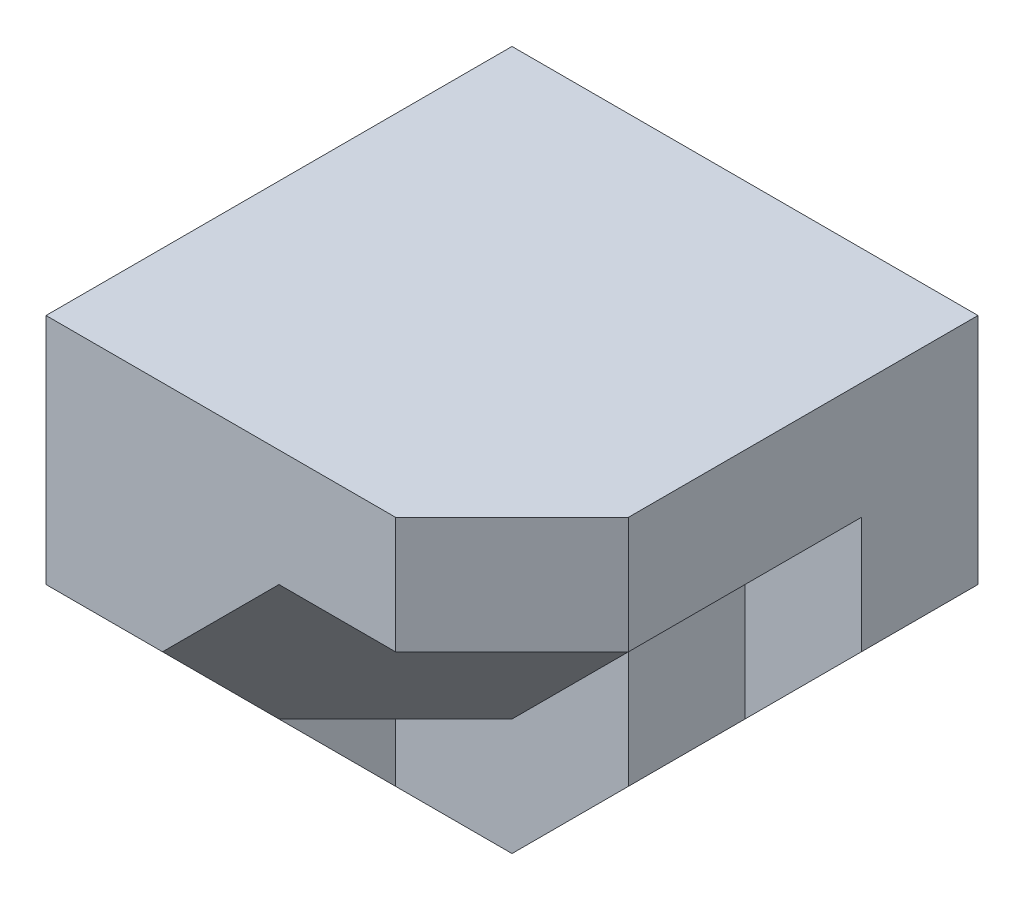
ISO-10303-21;
HEADER;
FILE_DESCRIPTION(('STEP AP214'),'2;1');
FILE_NAME('part.step','',(''),(''),'','','');
FILE_SCHEMA(('AUTOMOTIVE_DESIGN { 1 0 10303 214 1 1 1 1 }'));
ENDSEC;
DATA;
#1=APPLICATION_CONTEXT('core data for automotive mechanical design processes');
#2=APPLICATION_PROTOCOL_DEFINITION('international standard','automotive_design',2000,#1);
#3=PRODUCT_CONTEXT('',#1,'mechanical');
#4=PRODUCT('Part','Part','',(#3));
#5=PRODUCT_RELATED_PRODUCT_CATEGORY('part','',(#4));
#6=PRODUCT_DEFINITION_FORMATION('','',#4);
#7=PRODUCT_DEFINITION_CONTEXT('part definition',#1,'design');
#8=PRODUCT_DEFINITION('design','',#6,#7);
#9=PRODUCT_DEFINITION_SHAPE('','',#8);
#10=(LENGTH_UNIT() NAMED_UNIT(*) SI_UNIT(.MILLI.,.METRE.));
#11=(NAMED_UNIT(*) PLANE_ANGLE_UNIT() SI_UNIT($,.RADIAN.));
#12=(NAMED_UNIT(*) SI_UNIT($,.STERADIAN.) SOLID_ANGLE_UNIT());
#13=UNCERTAINTY_MEASURE_WITH_UNIT(LENGTH_MEASURE(1.E-05),#10,'distance_accuracy_value','');
#14=(GEOMETRIC_REPRESENTATION_CONTEXT(3) GLOBAL_UNCERTAINTY_ASSIGNED_CONTEXT((#13)) GLOBAL_UNIT_ASSIGNED_CONTEXT((#10,
#11,#12)) REPRESENTATION_CONTEXT('',''));
#15=CARTESIAN_POINT('',(0.,0.,0.));
#16=DIRECTION('',(0.,0.,1.));
#17=DIRECTION('',(1.,0.,0.));
#18=AXIS2_PLACEMENT_3D('',#15,#16,#17);
#19=CARTESIAN_POINT('',(0.,0.,20.));
#20=DIRECTION('',(0.,0.,-1.));
#21=DIRECTION('',(-1.,0.,0.));
#22=AXIS2_PLACEMENT_3D('',#19,#20,#21);
#23=PLANE('',#22);
#24=DIRECTION('',(0.707106781186548,0.707106781186548,0.));
#25=VECTOR('',#24,1.);
#26=CARTESIAN_POINT('',(40.,30.,20.));
#27=LINE('',#26,#25);
#28=CARTESIAN_POINT('',(20.,10.,20.));
#29=VERTEX_POINT('',#28);
#30=CARTESIAN_POINT('',(30.,20.,20.));
#31=VERTEX_POINT('',#30);
#32=EDGE_CURVE('E78',#29,#31,#27,.T.);
#33=ORIENTED_EDGE('',*,*,#32,.F.);
#34=DIRECTION('',(1.,0.,0.));
#35=VECTOR('',#34,1.);
#36=CARTESIAN_POINT('',(20.,10.,20.));
#37=LINE('',#36,#35);
#38=CARTESIAN_POINT('',(10.,10.,20.));
#39=VERTEX_POINT('',#38);
#40=EDGE_CURVE('E179',#39,#29,#37,.T.);
#41=ORIENTED_EDGE('',*,*,#40,.F.);
#42=DIRECTION('',(0.,-1.,0.));
#43=VECTOR('',#42,1.);
#44=CARTESIAN_POINT('',(10.,30.,20.));
#45=LINE('',#44,#43);
#46=CARTESIAN_POINT('',(10.,0.,20.));
#47=VERTEX_POINT('',#46);
#48=EDGE_CURVE('E126',#39,#47,#45,.T.);
#49=ORIENTED_EDGE('',*,*,#48,.T.);
#50=DIRECTION('',(1.,0.,0.));
#51=VECTOR('',#50,1.);
#52=CARTESIAN_POINT('',(0.,0.,20.));
#53=LINE('',#52,#51);
#54=CARTESIAN_POINT('',(20.,0.,20.));
#55=VERTEX_POINT('',#54);
#56=EDGE_CURVE('E145',#47,#55,#53,.T.);
#57=ORIENTED_EDGE('',*,*,#56,.T.);
#58=DIRECTION('',(-0.707106781186548,-0.707106781186548,0.));
#59=VECTOR('',#58,1.);
#60=CARTESIAN_POINT('',(20.,0.,20.));
#61=LINE('',#60,#59);
#62=CARTESIAN_POINT('',(30.,10.,20.));
#63=VERTEX_POINT('',#62);
#64=EDGE_CURVE('E317',#63,#55,#61,.T.);
#65=ORIENTED_EDGE('',*,*,#64,.F.);
#66=DIRECTION('',(0.,1.,0.));
#67=VECTOR('',#66,1.);
#68=CARTESIAN_POINT('',(30.,0.,20.));
#69=LINE('',#68,#67);
#70=EDGE_CURVE('E123',#63,#31,#69,.T.);
#71=ORIENTED_EDGE('',*,*,#70,.T.);
#72=EDGE_LOOP('',(#33,#41,#49,#57,#65,#71));
#73=FACE_BOUND('',#72,.T.);
#74=ADVANCED_FACE('F36',(#73),#23,.F.);
#75=CARTESIAN_POINT('',(10.,0.,0.));
#76=DIRECTION('',(-1.,0.,0.));
#77=DIRECTION('',(0.,0.,1.));
#78=AXIS2_PLACEMENT_3D('',#75,#76,#77);
#79=PLANE('',#78);
#80=DIRECTION('',(0.,0.,-1.));
#81=VECTOR('',#80,1.);
#82=CARTESIAN_POINT('',(10.,10.,40.));
#83=LINE('',#82,#81);
#84=CARTESIAN_POINT('',(10.,10.,30.));
#85=VERTEX_POINT('',#84);
#86=EDGE_CURVE('E183',#85,#39,#83,.T.);
#87=ORIENTED_EDGE('',*,*,#86,.F.);
#88=DIRECTION('',(0.,0.707106781186547,0.707106781186548));
#89=VECTOR('',#88,1.);
#90=CARTESIAN_POINT('',(10.,10.,30.));
#91=LINE('',#90,#89);
#92=EDGE_CURVE('E198',#47,#85,#91,.T.);
#93=ORIENTED_EDGE('',*,*,#92,.F.);
#94=ORIENTED_EDGE('',*,*,#48,.F.);
#95=EDGE_LOOP('',(#87,#93,#94));
#96=FACE_BOUND('',#95,.T.);
#97=ADVANCED_FACE('F350',(#96),#79,.F.);
#98=CARTESIAN_POINT('',(40.,0.,20.));
#99=DIRECTION('',(-1.,0.,0.));
#100=DIRECTION('',(0.,0.,1.));
#101=AXIS2_PLACEMENT_3D('',#98,#99,#100);
#102=PLANE('',#101);
#103=DIRECTION('',(0.,0.,-1.));
#104=VECTOR('',#103,1.);
#105=CARTESIAN_POINT('',(40.,40.,20.));
#106=LINE('',#105,#104);
#107=CARTESIAN_POINT('',(40.,40.,30.));
#108=VERTEX_POINT('',#107);
#109=CARTESIAN_POINT('',(40.,40.,0.));
#110=VERTEX_POINT('',#109);
#111=EDGE_CURVE('E143',#108,#110,#106,.T.);
#112=ORIENTED_EDGE('',*,*,#111,.F.);
#113=DIRECTION('',(0.,-1.,0.));
#114=VECTOR('',#113,1.);
#115=CARTESIAN_POINT('',(40.,70.,30.));
#116=LINE('',#115,#114);
#117=CARTESIAN_POINT('',(40.,30.,30.));
#118=VERTEX_POINT('',#117);
#119=EDGE_CURVE('E97',#108,#118,#116,.T.);
#120=ORIENTED_EDGE('',*,*,#119,.T.);
#121=DIRECTION('',(0.,0.,-1.));
#122=VECTOR('',#121,1.);
#123=CARTESIAN_POINT('',(40.,30.,10.));
#124=LINE('',#123,#122);
#125=CARTESIAN_POINT('',(40.,30.,20.));
#126=VERTEX_POINT('',#125);
#127=EDGE_CURVE('E54',#118,#126,#124,.T.);
#128=ORIENTED_EDGE('',*,*,#127,.T.);
#129=DIRECTION('',(0.,0.,1.));
#130=VECTOR('',#129,1.);
#131=CARTESIAN_POINT('',(40.,30.,10.));
#132=LINE('',#131,#130);
#133=CARTESIAN_POINT('',(40.,30.,10.));
#134=VERTEX_POINT('',#133);
#135=EDGE_CURVE('E95',#134,#126,#132,.T.);
#136=ORIENTED_EDGE('',*,*,#135,.F.);
#137=DIRECTION('',(0.,1.,0.));
#138=VECTOR('',#137,1.);
#139=CARTESIAN_POINT('',(40.,0.,10.));
#140=LINE('',#139,#138);
#141=CARTESIAN_POINT('',(40.,20.,10.));
#142=VERTEX_POINT('',#141);
#143=EDGE_CURVE('E127',#142,#134,#140,.T.);
#144=ORIENTED_EDGE('',*,*,#143,.F.);
#145=DIRECTION('',(0.,0.,1.));
#146=VECTOR('',#145,1.);
#147=CARTESIAN_POINT('',(40.,20.,0.));
#148=LINE('',#147,#146);
#149=CARTESIAN_POINT('',(40.,20.,0.));
#150=VERTEX_POINT('',#149);
#151=EDGE_CURVE('E165',#150,#142,#148,.T.);
#152=ORIENTED_EDGE('',*,*,#151,.F.);
#153=DIRECTION('',(0.,1.,0.));
#154=VECTOR('',#153,1.);
#155=CARTESIAN_POINT('',(40.,0.,0.));
#156=LINE('',#155,#154);
#157=EDGE_CURVE('E98',#150,#110,#156,.T.);
#158=ORIENTED_EDGE('',*,*,#157,.T.);
#159=EDGE_LOOP('',(#112,#120,#128,#136,#144,#152,#158));
#160=FACE_BOUND('',#159,.T.);
#161=ADVANCED_FACE('F92',(#160),#102,.F.);
#162=CARTESIAN_POINT('',(20.,0.,0.));
#163=DIRECTION('',(-0.707106781186548,0.707106781186548,0.));
#164=DIRECTION('',(-0.707106781186548,-0.707106781186548,0.));
#165=AXIS2_PLACEMENT_3D('',#162,#163,#164);
#166=PLANE('',#165);
#167=DIRECTION('',(0.,0.,1.));
#168=VECTOR('',#167,1.);
#169=CARTESIAN_POINT('',(30.,10.,10.));
#170=LINE('',#169,#168);
#171=CARTESIAN_POINT('',(30.,10.,10.));
#172=VERTEX_POINT('',#171);
#173=EDGE_CURVE('E121',#172,#63,#170,.T.);
#174=ORIENTED_EDGE('',*,*,#173,.T.);
#175=ORIENTED_EDGE('',*,*,#64,.T.);
#176=DIRECTION('',(0.,0.,1.));
#177=VECTOR('',#176,1.);
#178=CARTESIAN_POINT('',(20.,0.,0.));
#179=LINE('',#178,#177);
#180=CARTESIAN_POINT('',(20.,0.,0.));
#181=VERTEX_POINT('',#180);
#182=EDGE_CURVE('E310',#181,#55,#179,.T.);
#183=ORIENTED_EDGE('',*,*,#182,.F.);
#184=DIRECTION('',(-0.707106781186548,-0.707106781186548,0.));
#185=VECTOR('',#184,1.);
#186=CARTESIAN_POINT('',(20.,0.,0.));
#187=LINE('',#186,#185);
#188=EDGE_CURVE('E109',#150,#181,#187,.T.);
#189=ORIENTED_EDGE('',*,*,#188,.F.);
#190=ORIENTED_EDGE('',*,*,#151,.T.);
#191=DIRECTION('',(0.707106781186548,0.707106781186548,0.));
#192=VECTOR('',#191,1.);
#193=CARTESIAN_POINT('',(10.,-10.,10.));
#194=LINE('',#193,#192);
#195=EDGE_CURVE('E130',#172,#142,#194,.T.);
#196=ORIENTED_EDGE('',*,*,#195,.F.);
#197=EDGE_LOOP('',(#174,#175,#183,#189,#190,#196));
#198=FACE_BOUND('',#197,.T.);
#199=ADVANCED_FACE('F330',(#198),#166,.F.);
#200=CARTESIAN_POINT('',(0.,0.,20.));
#201=DIRECTION('',(1.,0.,0.));
#202=DIRECTION('',(0.,0.,-1.));
#203=AXIS2_PLACEMENT_3D('',#200,#201,#202);
#204=PLANE('',#203);
#205=DIRECTION('',(0.,0.,-1.));
#206=VECTOR('',#205,1.);
#207=CARTESIAN_POINT('',(0.,0.,20.));
#208=LINE('',#207,#206);
#209=CARTESIAN_POINT('',(0.,0.,20.));
#210=VERTEX_POINT('',#209);
#211=CARTESIAN_POINT('',(0.,0.,0.));
#212=VERTEX_POINT('',#211);
#213=EDGE_CURVE('E137',#210,#212,#208,.T.);
#214=ORIENTED_EDGE('',*,*,#213,.F.);
#215=DIRECTION('',(0.,0.707106781186547,0.707106781186548));
#216=VECTOR('',#215,1.);
#217=CARTESIAN_POINT('',(0.,10.,30.));
#218=LINE('',#217,#216);
#219=CARTESIAN_POINT('',(0.,10.,30.));
#220=VERTEX_POINT('',#219);
#221=EDGE_CURVE('E162',#210,#220,#218,.T.);
#222=ORIENTED_EDGE('',*,*,#221,.T.);
#223=DIRECTION('',(0.,1.,0.));
#224=VECTOR('',#223,1.);
#225=CARTESIAN_POINT('',(0.,20.,30.));
#226=LINE('',#225,#224);
#227=CARTESIAN_POINT('',(0.,20.,30.));
#228=VERTEX_POINT('',#227);
#229=EDGE_CURVE('E153',#220,#228,#226,.T.);
#230=ORIENTED_EDGE('',*,*,#229,.T.);
#231=DIRECTION('',(0.,0.,1.));
#232=VECTOR('',#231,1.);
#233=CARTESIAN_POINT('',(0.,20.,20.));
#234=LINE('',#233,#232);
#235=CARTESIAN_POINT('',(0.,20.,40.));
#236=VERTEX_POINT('',#235);
#237=EDGE_CURVE('E149',#228,#236,#234,.T.);
#238=ORIENTED_EDGE('',*,*,#237,.T.);
#239=DIRECTION('',(0.,-1.,0.));
#240=VECTOR('',#239,1.);
#241=CARTESIAN_POINT('',(0.,40.,40.));
#242=LINE('',#241,#240);
#243=CARTESIAN_POINT('',(0.,40.,40.));
#244=VERTEX_POINT('',#243);
#245=EDGE_CURVE('E138',#244,#236,#242,.T.);
#246=ORIENTED_EDGE('',*,*,#245,.F.);
#247=DIRECTION('',(0.,0.,-1.));
#248=VECTOR('',#247,1.);
#249=CARTESIAN_POINT('',(0.,40.,20.));
#250=LINE('',#249,#248);
#251=CARTESIAN_POINT('',(0.,40.,0.));
#252=VERTEX_POINT('',#251);
#253=EDGE_CURVE('E152',#244,#252,#250,.T.);
#254=ORIENTED_EDGE('',*,*,#253,.T.);
#255=DIRECTION('',(0.,-1.,0.));
#256=VECTOR('',#255,1.);
#257=CARTESIAN_POINT('',(0.,0.,0.));
#258=LINE('',#257,#256);
#259=EDGE_CURVE('E298',#252,#212,#258,.T.);
#260=ORIENTED_EDGE('',*,*,#259,.T.);
#261=EDGE_LOOP('',(#214,#222,#230,#238,#246,#254,#260));
#262=FACE_BOUND('',#261,.T.);
#263=ADVANCED_FACE('F221',(#262),#204,.F.);
#264=CARTESIAN_POINT('',(0.,0.,20.));
#265=DIRECTION('',(0.,1.,0.));
#266=DIRECTION('',(0.,0.,1.));
#267=AXIS2_PLACEMENT_3D('',#264,#265,#266);
#268=PLANE('',#267);
#269=DIRECTION('',(1.,0.,0.));
#270=VECTOR('',#269,1.);
#271=CARTESIAN_POINT('',(0.,0.,0.));
#272=LINE('',#271,#270);
#273=EDGE_CURVE('E308',#212,#181,#272,.T.);
#274=ORIENTED_EDGE('',*,*,#273,.T.);
#275=ORIENTED_EDGE('',*,*,#182,.T.);
#276=ORIENTED_EDGE('',*,*,#56,.F.);
#277=EDGE_CURVE('E159',#210,#47,#53,.T.);
#278=ORIENTED_EDGE('',*,*,#277,.F.);
#279=ORIENTED_EDGE('',*,*,#213,.T.);
#280=EDGE_LOOP('',(#274,#275,#276,#278,#279));
#281=FACE_BOUND('',#280,.T.);
#282=ADVANCED_FACE('F333',(#281),#268,.F.);
#283=CARTESIAN_POINT('',(0.,40.,20.));
#284=DIRECTION('',(0.,-1.,0.));
#285=DIRECTION('',(0.,0.,-1.));
#286=AXIS2_PLACEMENT_3D('',#283,#284,#285);
#287=PLANE('',#286);
#288=DIRECTION('',(1.,0.,0.));
#289=VECTOR('',#288,1.);
#290=CARTESIAN_POINT('',(0.,40.,40.));
#291=LINE('',#290,#289);
#292=CARTESIAN_POINT('',(30.,40.,40.));
#293=VERTEX_POINT('',#292);
#294=EDGE_CURVE('E133',#244,#293,#291,.T.);
#295=ORIENTED_EDGE('',*,*,#294,.T.);
#296=DIRECTION('',(0.707106781186547,0.,-0.707106781186548));
#297=VECTOR('',#296,1.);
#298=CARTESIAN_POINT('',(25.,40.,45.));
#299=LINE('',#298,#297);
#300=EDGE_CURVE('E136',#293,#108,#299,.T.);
#301=ORIENTED_EDGE('',*,*,#300,.T.);
#302=ORIENTED_EDGE('',*,*,#111,.T.);
#303=DIRECTION('',(-1.,0.,0.));
#304=VECTOR('',#303,1.);
#305=CARTESIAN_POINT('',(0.,40.,0.));
#306=LINE('',#305,#304);
#307=EDGE_CURVE('E306',#110,#252,#306,.T.);
#308=ORIENTED_EDGE('',*,*,#307,.T.);
#309=ORIENTED_EDGE('',*,*,#253,.F.);
#310=EDGE_LOOP('',(#295,#301,#302,#308,#309));
#311=FACE_BOUND('',#310,.T.);
#312=ADVANCED_FACE('F370',(#311),#287,.F.);
#313=CARTESIAN_POINT('',(0.,0.,0.));
#314=DIRECTION('',(0.,0.,-1.));
#315=DIRECTION('',(-1.,0.,0.));
#316=AXIS2_PLACEMENT_3D('',#313,#314,#315);
#317=PLANE('',#316);
#318=ORIENTED_EDGE('',*,*,#188,.T.);
#319=ORIENTED_EDGE('',*,*,#273,.F.);
#320=ORIENTED_EDGE('',*,*,#259,.F.);
#321=ORIENTED_EDGE('',*,*,#307,.F.);
#322=ORIENTED_EDGE('',*,*,#157,.F.);
#323=EDGE_LOOP('',(#318,#319,#320,#321,#322));
#324=FACE_BOUND('',#323,.T.);
#325=ADVANCED_FACE('F304',(#324),#317,.T.);
#326=CARTESIAN_POINT('',(5.,-5.,10.));
#327=DIRECTION('',(0.707106781186548,-0.707106781186548,0.));
#328=DIRECTION('',(0.707106781186548,0.707106781186548,0.));
#329=AXIS2_PLACEMENT_3D('',#326,#327,#328);
#330=PLANE('',#329);
#331=DIRECTION('',(0.707106781186548,0.707106781186547,0.));
#332=VECTOR('',#331,1.);
#333=CARTESIAN_POINT('',(20.,10.,20.));
#334=LINE('',#333,#332);
#335=EDGE_CURVE('E46',#31,#126,#334,.T.);
#336=ORIENTED_EDGE('',*,*,#335,.F.);
#337=DIRECTION('',(0.,0.,1.));
#338=VECTOR('',#337,1.);
#339=CARTESIAN_POINT('',(30.,20.,10.));
#340=LINE('',#339,#338);
#341=CARTESIAN_POINT('',(30.,20.,10.));
#342=VERTEX_POINT('',#341);
#343=EDGE_CURVE('E107',#342,#31,#340,.T.);
#344=ORIENTED_EDGE('',*,*,#343,.F.);
#345=DIRECTION('',(0.707106781186548,0.707106781186548,0.));
#346=VECTOR('',#345,1.);
#347=CARTESIAN_POINT('',(5.,-5.,10.));
#348=LINE('',#347,#346);
#349=EDGE_CURVE('E102',#342,#134,#348,.T.);
#350=ORIENTED_EDGE('',*,*,#349,.T.);
#351=ORIENTED_EDGE('',*,*,#135,.T.);
#352=EDGE_LOOP('',(#336,#344,#350,#351));
#353=FACE_BOUND('',#352,.T.);
#354=ADVANCED_FACE('F38',(#353),#330,.T.);
#355=CARTESIAN_POINT('',(30.,0.,10.));
#356=DIRECTION('',(1.,0.,0.));
#357=DIRECTION('',(0.,0.,-1.));
#358=AXIS2_PLACEMENT_3D('',#355,#356,#357);
#359=PLANE('',#358);
#360=ORIENTED_EDGE('',*,*,#70,.F.);
#361=ORIENTED_EDGE('',*,*,#173,.F.);
#362=DIRECTION('',(0.,1.,0.));
#363=VECTOR('',#362,1.);
#364=CARTESIAN_POINT('',(30.,0.,10.));
#365=LINE('',#364,#363);
#366=EDGE_CURVE('E104',#172,#342,#365,.T.);
#367=ORIENTED_EDGE('',*,*,#366,.T.);
#368=ORIENTED_EDGE('',*,*,#343,.T.);
#369=EDGE_LOOP('',(#360,#361,#367,#368));
#370=FACE_BOUND('',#369,.T.);
#371=ADVANCED_FACE('F323',(#370),#359,.T.);
#372=CARTESIAN_POINT('',(0.,0.,10.));
#373=DIRECTION('',(0.,0.,1.));
#374=DIRECTION('',(1.,0.,0.));
#375=AXIS2_PLACEMENT_3D('',#372,#373,#374);
#376=PLANE('',#375);
#377=ORIENTED_EDGE('',*,*,#349,.F.);
#378=ORIENTED_EDGE('',*,*,#366,.F.);
#379=ORIENTED_EDGE('',*,*,#195,.T.);
#380=ORIENTED_EDGE('',*,*,#143,.T.);
#381=EDGE_LOOP('',(#377,#378,#379,#380));
#382=FACE_BOUND('',#381,.T.);
#383=ADVANCED_FACE('F339',(#382),#376,.T.);
#384=CARTESIAN_POINT('',(0.,40.,40.));
#385=DIRECTION('',(0.,0.,1.));
#386=DIRECTION('',(0.,-1.,0.));
#387=AXIS2_PLACEMENT_3D('',#384,#385,#386);
#388=PLANE('',#387);
#389=DIRECTION('',(0.707106781186547,0.707106781186548,0.));
#390=VECTOR('',#389,1.);
#391=CARTESIAN_POINT('',(10.,20.,40.));
#392=LINE('',#391,#390);
#393=CARTESIAN_POINT('',(10.,20.,40.));
#394=VERTEX_POINT('',#393);
#395=CARTESIAN_POINT('',(20.,30.,40.));
#396=VERTEX_POINT('',#395);
#397=EDGE_CURVE('E129',#394,#396,#392,.T.);
#398=ORIENTED_EDGE('',*,*,#397,.T.);
#399=DIRECTION('',(1.,0.,0.));
#400=VECTOR('',#399,1.);
#401=CARTESIAN_POINT('',(20.,30.,40.));
#402=LINE('',#401,#400);
#403=CARTESIAN_POINT('',(30.,30.,40.));
#404=VERTEX_POINT('',#403);
#405=EDGE_CURVE('E86',#396,#404,#402,.T.);
#406=ORIENTED_EDGE('',*,*,#405,.T.);
#407=DIRECTION('',(0.,-1.,0.));
#408=VECTOR('',#407,1.);
#409=CARTESIAN_POINT('',(30.,40.,40.));
#410=LINE('',#409,#408);
#411=EDGE_CURVE('E116',#293,#404,#410,.T.);
#412=ORIENTED_EDGE('',*,*,#411,.F.);
#413=ORIENTED_EDGE('',*,*,#294,.F.);
#414=ORIENTED_EDGE('',*,*,#245,.T.);
#415=DIRECTION('',(-1.,0.,0.));
#416=VECTOR('',#415,1.);
#417=CARTESIAN_POINT('',(10.,20.,40.));
#418=LINE('',#417,#416);
#419=EDGE_CURVE('E281',#394,#236,#418,.T.);
#420=ORIENTED_EDGE('',*,*,#419,.F.);
#421=EDGE_LOOP('',(#398,#406,#412,#413,#414,#420));
#422=FACE_BOUND('',#421,.T.);
#423=ADVANCED_FACE('F292',(#422),#388,.T.);
#424=CARTESIAN_POINT('',(40.,70.,30.));
#425=DIRECTION('',(-0.707106781186548,0.,-0.707106781186547));
#426=DIRECTION('',(-0.707106781186547,0.,0.707106781186548));
#427=AXIS2_PLACEMENT_3D('',#424,#425,#426);
#428=PLANE('',#427);
#429=ORIENTED_EDGE('',*,*,#411,.T.);
#430=DIRECTION('',(0.707106781186547,0.,-0.707106781186548));
#431=VECTOR('',#430,1.);
#432=CARTESIAN_POINT('',(40.,30.,30.));
#433=LINE('',#432,#431);
#434=EDGE_CURVE('E146',#404,#118,#433,.T.);
#435=ORIENTED_EDGE('',*,*,#434,.T.);
#436=ORIENTED_EDGE('',*,*,#119,.F.);
#437=ORIENTED_EDGE('',*,*,#300,.F.);
#438=EDGE_LOOP('',(#429,#435,#436,#437));
#439=FACE_BOUND('',#438,.T.);
#440=ADVANCED_FACE('F346',(#439),#428,.F.);
#441=CARTESIAN_POINT('',(10.,20.,20.));
#442=DIRECTION('',(0.,-1.,0.));
#443=DIRECTION('',(0.,0.,-1.));
#444=AXIS2_PLACEMENT_3D('',#441,#442,#443);
#445=PLANE('',#444);
#446=DIRECTION('',(-1.,0.,0.));
#447=VECTOR('',#446,1.);
#448=CARTESIAN_POINT('',(10.,20.,30.));
#449=LINE('',#448,#447);
#450=CARTESIAN_POINT('',(10.,20.,30.));
#451=VERTEX_POINT('',#450);
#452=EDGE_CURVE('E156',#451,#228,#449,.T.);
#453=ORIENTED_EDGE('',*,*,#452,.F.);
#454=DIRECTION('',(0.,0.,1.));
#455=VECTOR('',#454,1.);
#456=CARTESIAN_POINT('',(10.,20.,20.));
#457=LINE('',#456,#455);
#458=EDGE_CURVE('E148',#451,#394,#457,.T.);
#459=ORIENTED_EDGE('',*,*,#458,.T.);
#460=ORIENTED_EDGE('',*,*,#419,.T.);
#461=ORIENTED_EDGE('',*,*,#237,.F.);
#462=EDGE_LOOP('',(#453,#459,#460,#461));
#463=FACE_BOUND('',#462,.T.);
#464=ADVANCED_FACE('F232',(#463),#445,.T.);
#465=CARTESIAN_POINT('',(10.,20.,30.));
#466=DIRECTION('',(0.,0.,1.));
#467=DIRECTION('',(1.,0.,0.));
#468=AXIS2_PLACEMENT_3D('',#465,#466,#467);
#469=PLANE('',#468);
#470=ORIENTED_EDGE('',*,*,#229,.F.);
#471=DIRECTION('',(-1.,0.,0.));
#472=VECTOR('',#471,1.);
#473=CARTESIAN_POINT('',(10.,10.,30.));
#474=LINE('',#473,#472);
#475=EDGE_CURVE('E180',#85,#220,#474,.T.);
#476=ORIENTED_EDGE('',*,*,#475,.F.);
#477=DIRECTION('',(0.,1.,0.));
#478=VECTOR('',#477,1.);
#479=CARTESIAN_POINT('',(10.,20.,30.));
#480=LINE('',#479,#478);
#481=EDGE_CURVE('E114',#85,#451,#480,.T.);
#482=ORIENTED_EDGE('',*,*,#481,.T.);
#483=ORIENTED_EDGE('',*,*,#452,.T.);
#484=EDGE_LOOP('',(#470,#476,#482,#483));
#485=FACE_BOUND('',#484,.T.);
#486=ADVANCED_FACE('F224',(#485),#469,.T.);
#487=CARTESIAN_POINT('',(10.,10.,30.));
#488=DIRECTION('',(0.,-0.707106781186548,0.707106781186547));
#489=DIRECTION('',(0.,-0.707106781186547,-0.707106781186548));
#490=AXIS2_PLACEMENT_3D('',#487,#488,#489);
#491=PLANE('',#490);
#492=ORIENTED_EDGE('',*,*,#221,.F.);
#493=ORIENTED_EDGE('',*,*,#277,.T.);
#494=ORIENTED_EDGE('',*,*,#92,.T.);
#495=ORIENTED_EDGE('',*,*,#475,.T.);
#496=EDGE_LOOP('',(#492,#493,#494,#495));
#497=FACE_BOUND('',#496,.T.);
#498=ADVANCED_FACE('F209',(#497),#491,.T.);
#499=CARTESIAN_POINT('',(10.,10.,40.));
#500=DIRECTION('',(1.,0.,0.));
#501=DIRECTION('',(0.,0.,-1.));
#502=AXIS2_PLACEMENT_3D('',#499,#500,#501);
#503=PLANE('',#502);
#504=ORIENTED_EDGE('',*,*,#481,.F.);
#505=DIRECTION('',(0.,0.707106781186547,0.707106781186548));
#506=VECTOR('',#505,1.);
#507=CARTESIAN_POINT('',(10.,10.,30.));
#508=LINE('',#507,#506);
#509=EDGE_CURVE('E176',#85,#394,#508,.T.);
#510=ORIENTED_EDGE('',*,*,#509,.T.);
#511=ORIENTED_EDGE('',*,*,#458,.F.);
#512=EDGE_LOOP('',(#504,#510,#511));
#513=FACE_BOUND('',#512,.T.);
#514=ADVANCED_FACE('F280',(#513),#503,.F.);
#515=CARTESIAN_POINT('',(20.,10.,40.));
#516=DIRECTION('',(0.,1.,0.));
#517=DIRECTION('',(0.,0.,1.));
#518=AXIS2_PLACEMENT_3D('',#515,#516,#517);
#519=PLANE('',#518);
#520=ORIENTED_EDGE('',*,*,#40,.T.);
#521=DIRECTION('',(0.707106781186548,0.,-0.707106781186547));
#522=VECTOR('',#521,1.);
#523=CARTESIAN_POINT('',(10.,10.,30.));
#524=LINE('',#523,#522);
#525=EDGE_CURVE('E182',#85,#29,#524,.T.);
#526=ORIENTED_EDGE('',*,*,#525,.F.);
#527=ORIENTED_EDGE('',*,*,#86,.T.);
#528=EDGE_LOOP('',(#520,#526,#527));
#529=FACE_BOUND('',#528,.T.);
#530=ADVANCED_FACE('F394',(#529),#519,.F.);
#531=CARTESIAN_POINT('',(9.99999999999998,-9.99999999999999,9.99999999999997));
#532=DIRECTION('',(-0.577350269189626,0.577350269189626,-0.577350269189625));
#533=DIRECTION('',(-0.707106781186548,-0.707106781186547,0.));
#534=AXIS2_PLACEMENT_3D('',#531,#532,#533);
#535=PLANE('',#534);
#536=ORIENTED_EDGE('',*,*,#525,.T.);
#537=ORIENTED_EDGE('',*,*,#32,.T.);
#538=ORIENTED_EDGE('',*,*,#335,.T.);
#539=DIRECTION('',(0.707106781186547,0.,-0.707106781186548));
#540=VECTOR('',#539,1.);
#541=CARTESIAN_POINT('',(20.,30.,40.));
#542=LINE('',#541,#540);
#543=EDGE_CURVE('E12',#396,#126,#542,.T.);
#544=ORIENTED_EDGE('',*,*,#543,.F.);
#545=ORIENTED_EDGE('',*,*,#397,.F.);
#546=ORIENTED_EDGE('',*,*,#509,.F.);
#547=EDGE_LOOP('',(#536,#537,#538,#544,#545,#546));
#548=FACE_BOUND('',#547,.T.);
#549=ADVANCED_FACE('F75',(#548),#535,.F.);
#550=CARTESIAN_POINT('',(20.,30.,40.));
#551=DIRECTION('',(0.,-1.,0.));
#552=DIRECTION('',(0.,0.,-1.));
#553=AXIS2_PLACEMENT_3D('',#550,#551,#552);
#554=PLANE('',#553);
#555=ORIENTED_EDGE('',*,*,#434,.F.);
#556=ORIENTED_EDGE('',*,*,#405,.F.);
#557=ORIENTED_EDGE('',*,*,#543,.T.);
#558=ORIENTED_EDGE('',*,*,#127,.F.);
#559=EDGE_LOOP('',(#555,#556,#557,#558));
#560=FACE_BOUND('',#559,.T.);
#561=ADVANCED_FACE('F84',(#560),#554,.T.);
#562=CLOSED_SHELL('',(#74,#97,#161,#199,#263,#282,#312,#325,#354,#371,#383,#423,#440,#464,#486,
#498,#514,#530,#549,#561));
#563=MANIFOLD_SOLID_BREP('B2',#562);
#564=ADVANCED_BREP_SHAPE_REPRESENTATION('',(#18,#563),#14);
#565=SHAPE_DEFINITION_REPRESENTATION(#9,#564);
ENDSEC;
END-ISO-10303-21;
